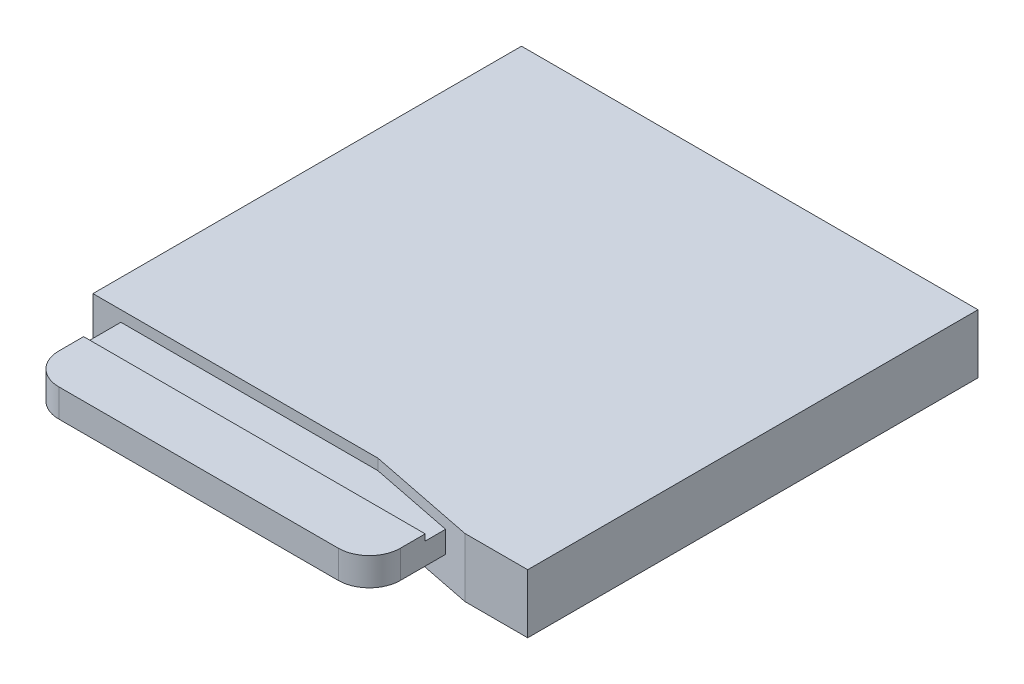
ISO-10303-21;
HEADER;
FILE_DESCRIPTION(('STEP AP214'),'2;1');
FILE_NAME('part.step','',(''),(''),'','','');
FILE_SCHEMA(('AUTOMOTIVE_DESIGN { 1 0 10303 214 1 1 1 1 }'));
ENDSEC;
DATA;
#1=APPLICATION_CONTEXT('core data for automotive mechanical design processes');
#2=APPLICATION_PROTOCOL_DEFINITION('international standard','automotive_design',2000,#1);
#3=PRODUCT_CONTEXT('',#1,'mechanical');
#4=PRODUCT('Part','Part','',(#3));
#5=PRODUCT_RELATED_PRODUCT_CATEGORY('part','',(#4));
#6=PRODUCT_DEFINITION_FORMATION('','',#4);
#7=PRODUCT_DEFINITION_CONTEXT('part definition',#1,'design');
#8=PRODUCT_DEFINITION('design','',#6,#7);
#9=PRODUCT_DEFINITION_SHAPE('','',#8);
#10=(LENGTH_UNIT() NAMED_UNIT(*) SI_UNIT(.MILLI.,.METRE.));
#11=(NAMED_UNIT(*) PLANE_ANGLE_UNIT() SI_UNIT($,.RADIAN.));
#12=(NAMED_UNIT(*) SI_UNIT($,.STERADIAN.) SOLID_ANGLE_UNIT());
#13=UNCERTAINTY_MEASURE_WITH_UNIT(LENGTH_MEASURE(1.E-05),#10,'distance_accuracy_value','');
#14=(GEOMETRIC_REPRESENTATION_CONTEXT(3) GLOBAL_UNCERTAINTY_ASSIGNED_CONTEXT((#13)) GLOBAL_UNIT_ASSIGNED_CONTEXT((#10,
#11,#12)) REPRESENTATION_CONTEXT('',''));
#15=CARTESIAN_POINT('',(0.,0.,0.));
#16=DIRECTION('',(0.,0.,1.));
#17=DIRECTION('',(1.,0.,0.));
#18=AXIS2_PLACEMENT_3D('',#15,#16,#17);
#19=CARTESIAN_POINT('',(3.05,-0.55,3.25));
#20=DIRECTION('',(0.,-1.,0.));
#21=DIRECTION('',(0.,0.,-1.));
#22=AXIS2_PLACEMENT_3D('',#19,#20,#21);
#23=PLANE('',#22);
#24=CARTESIAN_POINT('',(3.05,-0.55,3.25));
#25=DIRECTION('',(0.,-1.,0.));
#26=DIRECTION('',(0.,0.,-1.));
#27=AXIS2_PLACEMENT_3D('',#24,#25,#26);
#28=CIRCLE('',#27,0.3);
#29=CARTESIAN_POINT('',(3.05,-0.55,2.95));
#30=VERTEX_POINT('',#29);
#31=EDGE_CURVE('E377',#30,#30,#28,.T.);
#32=ORIENTED_EDGE('',*,*,#31,.T.);
#33=EDGE_LOOP('',(#32));
#34=FACE_BOUND('',#33,.T.);
#35=ADVANCED_FACE('F17',(#34),#23,.T.);
#36=CARTESIAN_POINT('',(-4.95,-0.55,3.25));
#37=DIRECTION('',(0.,-1.,0.));
#38=DIRECTION('',(0.,0.,-1.));
#39=AXIS2_PLACEMENT_3D('',#36,#37,#38);
#40=PLANE('',#39);
#41=CARTESIAN_POINT('',(-4.95,-0.55,3.25));
#42=DIRECTION('',(0.,-1.,0.));
#43=DIRECTION('',(0.,0.,-1.));
#44=AXIS2_PLACEMENT_3D('',#41,#42,#43);
#45=CIRCLE('',#44,0.3);
#46=CARTESIAN_POINT('',(-4.95,-0.55,2.95));
#47=VERTEX_POINT('',#46);
#48=EDGE_CURVE('E385',#47,#47,#45,.T.);
#49=ORIENTED_EDGE('',*,*,#48,.T.);
#50=EDGE_LOOP('',(#49));
#51=FACE_BOUND('',#50,.T.);
#52=ADVANCED_FACE('F419',(#51),#40,.T.);
#53=CARTESIAN_POINT('',(3.55,0.,8.55));
#54=DIRECTION('',(0.,-1.,0.));
#55=DIRECTION('',(0.,0.,-1.));
#56=AXIS2_PLACEMENT_3D('',#53,#54,#55);
#57=CYLINDRICAL_SURFACE('',#56,1.);
#58=CARTESIAN_POINT('',(3.55,0.85,8.55));
#59=DIRECTION('',(0.,-1.,0.));
#60=DIRECTION('',(-1.,0.,0.));
#61=AXIS2_PLACEMENT_3D('',#58,#59,#60);
#62=CIRCLE('',#61,1.);
#63=CARTESIAN_POINT('',(4.55,0.85,8.55));
#64=VERTEX_POINT('',#63);
#65=CARTESIAN_POINT('',(3.55,0.85,9.55));
#66=VERTEX_POINT('',#65);
#67=EDGE_CURVE('E184',#64,#66,#62,.T.);
#68=ORIENTED_EDGE('',*,*,#67,.F.);
#69=DIRECTION('',(0.,-1.,0.));
#70=VECTOR('',#69,1.);
#71=CARTESIAN_POINT('',(4.55,0.85,8.55));
#72=LINE('',#71,#70);
#73=CARTESIAN_POINT('',(4.55,1.75,8.55));
#74=VERTEX_POINT('',#73);
#75=EDGE_CURVE('E233',#74,#64,#72,.T.);
#76=ORIENTED_EDGE('',*,*,#75,.F.);
#77=CARTESIAN_POINT('',(3.55,1.75,8.55));
#78=DIRECTION('',(0.,1.,0.));
#79=DIRECTION('',(1.,0.,0.));
#80=AXIS2_PLACEMENT_3D('',#77,#78,#79);
#81=CIRCLE('',#80,1.);
#82=CARTESIAN_POINT('',(3.55,1.75,9.55));
#83=VERTEX_POINT('',#82);
#84=EDGE_CURVE('E11',#83,#74,#81,.T.);
#85=ORIENTED_EDGE('',*,*,#84,.F.);
#86=DIRECTION('',(0.,1.,0.));
#87=VECTOR('',#86,1.);
#88=CARTESIAN_POINT('',(3.55,1.75,9.55));
#89=LINE('',#88,#87);
#90=EDGE_CURVE('E163',#66,#83,#89,.T.);
#91=ORIENTED_EDGE('',*,*,#90,.F.);
#92=EDGE_LOOP('',(#68,#76,#85,#91));
#93=FACE_BOUND('',#92,.T.);
#94=ADVANCED_FACE('F276',(#93),#57,.T.);
#95=CARTESIAN_POINT('',(-5.45,0.,8.55));
#96=DIRECTION('',(0.,1.,0.));
#97=DIRECTION('',(0.,0.,1.));
#98=AXIS2_PLACEMENT_3D('',#95,#96,#97);
#99=CYLINDRICAL_SURFACE('',#98,1.);
#100=CARTESIAN_POINT('',(-5.45,1.75,8.55));
#101=DIRECTION('',(0.,1.,0.));
#102=DIRECTION('',(1.,0.,0.));
#103=AXIS2_PLACEMENT_3D('',#100,#101,#102);
#104=CIRCLE('',#103,1.);
#105=CARTESIAN_POINT('',(-6.45,1.75,8.55));
#106=VERTEX_POINT('',#105);
#107=CARTESIAN_POINT('',(-5.45,1.75,9.55));
#108=VERTEX_POINT('',#107);
#109=EDGE_CURVE('E26',#106,#108,#104,.T.);
#110=ORIENTED_EDGE('',*,*,#109,.F.);
#111=DIRECTION('',(0.,1.,0.));
#112=VECTOR('',#111,1.);
#113=CARTESIAN_POINT('',(-6.45,1.75,8.55));
#114=LINE('',#113,#112);
#115=CARTESIAN_POINT('',(-6.45,0.85,8.55));
#116=VERTEX_POINT('',#115);
#117=EDGE_CURVE('E177',#116,#106,#114,.T.);
#118=ORIENTED_EDGE('',*,*,#117,.F.);
#119=CARTESIAN_POINT('',(-5.45,0.85,8.55));
#120=DIRECTION('',(0.,-1.,0.));
#121=DIRECTION('',(-1.,0.,0.));
#122=AXIS2_PLACEMENT_3D('',#119,#120,#121);
#123=CIRCLE('',#122,1.);
#124=CARTESIAN_POINT('',(-5.45,0.85,9.55));
#125=VERTEX_POINT('',#124);
#126=EDGE_CURVE('E249',#125,#116,#123,.T.);
#127=ORIENTED_EDGE('',*,*,#126,.F.);
#128=DIRECTION('',(0.,-1.,0.));
#129=VECTOR('',#128,1.);
#130=CARTESIAN_POINT('',(-5.45,0.85,9.55));
#131=LINE('',#130,#129);
#132=EDGE_CURVE('E245',#108,#125,#131,.T.);
#133=ORIENTED_EDGE('',*,*,#132,.F.);
#134=EDGE_LOOP('',(#110,#118,#127,#133));
#135=FACE_BOUND('',#134,.T.);
#136=ADVANCED_FACE('F270',(#135),#99,.T.);
#137=CARTESIAN_POINT('',(0.,1.75,0.));
#138=DIRECTION('',(0.,-1.,0.));
#139=DIRECTION('',(0.,0.,-1.));
#140=AXIS2_PLACEMENT_3D('',#137,#138,#139);
#141=PLANE('',#140);
#142=DIRECTION('',(0.,0.,1.));
#143=VECTOR('',#142,1.);
#144=CARTESIAN_POINT('',(-6.45,1.75,9.55));
#145=LINE('',#144,#143);
#146=CARTESIAN_POINT('',(-6.45,1.75,7.75));
#147=VERTEX_POINT('',#146);
#148=EDGE_CURVE('E156',#147,#106,#145,.T.);
#149=ORIENTED_EDGE('',*,*,#148,.T.);
#150=ORIENTED_EDGE('',*,*,#109,.T.);
#151=DIRECTION('',(1.,0.,0.));
#152=VECTOR('',#151,1.);
#153=CARTESIAN_POINT('',(-6.45,1.75,9.55));
#154=LINE('',#153,#152);
#155=EDGE_CURVE('E173',#108,#83,#154,.T.);
#156=ORIENTED_EDGE('',*,*,#155,.T.);
#157=ORIENTED_EDGE('',*,*,#84,.T.);
#158=DIRECTION('',(0.,0.,-1.));
#159=VECTOR('',#158,1.);
#160=CARTESIAN_POINT('',(4.55,1.75,9.55));
#161=LINE('',#160,#159);
#162=CARTESIAN_POINT('',(4.55,1.75,7.75));
#163=VERTEX_POINT('',#162);
#164=EDGE_CURVE('E159',#74,#163,#161,.T.);
#165=ORIENTED_EDGE('',*,*,#164,.T.);
#166=DIRECTION('',(-1.,0.,0.));
#167=VECTOR('',#166,1.);
#168=CARTESIAN_POINT('',(-6.45,1.75,7.75));
#169=LINE('',#168,#167);
#170=EDGE_CURVE('E152',#163,#147,#169,.T.);
#171=ORIENTED_EDGE('',*,*,#170,.T.);
#172=EDGE_LOOP('',(#149,#150,#156,#157,#165,#171));
#173=FACE_BOUND('',#172,.T.);
#174=ADVANCED_FACE('F154',(#173),#141,.F.);
#175=CARTESIAN_POINT('',(-6.45,1.75,7.75));
#176=DIRECTION('',(0.,0.,1.));
#177=DIRECTION('',(1.,0.,0.));
#178=AXIS2_PLACEMENT_3D('',#175,#176,#177);
#179=PLANE('',#178);
#180=DIRECTION('',(-1.,0.,0.));
#181=VECTOR('',#180,1.);
#182=CARTESIAN_POINT('',(-6.45,1.55,7.75));
#183=LINE('',#182,#181);
#184=CARTESIAN_POINT('',(4.55,1.55,7.75));
#185=VERTEX_POINT('',#184);
#186=CARTESIAN_POINT('',(-6.45,1.55,7.75));
#187=VERTEX_POINT('',#186);
#188=EDGE_CURVE('E168',#185,#187,#183,.T.);
#189=ORIENTED_EDGE('',*,*,#188,.T.);
#190=DIRECTION('',(0.,-1.,0.));
#191=VECTOR('',#190,1.);
#192=CARTESIAN_POINT('',(-6.45,1.75,7.75));
#193=LINE('',#192,#191);
#194=EDGE_CURVE('E165',#147,#187,#193,.T.);
#195=ORIENTED_EDGE('',*,*,#194,.F.);
#196=ORIENTED_EDGE('',*,*,#170,.F.);
#197=DIRECTION('',(0.,-1.,0.));
#198=VECTOR('',#197,1.);
#199=CARTESIAN_POINT('',(4.55,1.75,7.75));
#200=LINE('',#199,#198);
#201=EDGE_CURVE('E238',#163,#185,#200,.T.);
#202=ORIENTED_EDGE('',*,*,#201,.T.);
#203=EDGE_LOOP('',(#189,#195,#196,#202));
#204=FACE_BOUND('',#203,.T.);
#205=ADVANCED_FACE('F166',(#204),#179,.F.);
#206=CARTESIAN_POINT('',(0.,0.,9.55));
#207=DIRECTION('',(0.,0.,1.));
#208=DIRECTION('',(1.,0.,0.));
#209=AXIS2_PLACEMENT_3D('',#206,#207,#208);
#210=PLANE('',#209);
#211=ORIENTED_EDGE('',*,*,#155,.F.);
#212=ORIENTED_EDGE('',*,*,#132,.T.);
#213=DIRECTION('',(1.,0.,0.));
#214=VECTOR('',#213,1.);
#215=CARTESIAN_POINT('',(-6.45,0.85,9.55));
#216=LINE('',#215,#214);
#217=EDGE_CURVE('E241',#125,#66,#216,.T.);
#218=ORIENTED_EDGE('',*,*,#217,.T.);
#219=ORIENTED_EDGE('',*,*,#90,.T.);
#220=EDGE_LOOP('',(#211,#212,#218,#219));
#221=FACE_BOUND('',#220,.T.);
#222=ADVANCED_FACE('F265',(#221),#210,.T.);
#223=CARTESIAN_POINT('',(-6.45,1.55,9.55));
#224=DIRECTION('',(1.,0.,0.));
#225=DIRECTION('',(0.,1.,0.));
#226=AXIS2_PLACEMENT_3D('',#223,#224,#225);
#227=PLANE('',#226);
#228=DIRECTION('',(0.,0.,-1.));
#229=VECTOR('',#228,1.);
#230=CARTESIAN_POINT('',(-6.45,0.85,9.55));
#231=LINE('',#230,#229);
#232=CARTESIAN_POINT('',(-6.45,0.85,6.55));
#233=VERTEX_POINT('',#232);
#234=EDGE_CURVE('E253',#116,#233,#231,.T.);
#235=ORIENTED_EDGE('',*,*,#234,.F.);
#236=ORIENTED_EDGE('',*,*,#117,.T.);
#237=ORIENTED_EDGE('',*,*,#148,.F.);
#238=ORIENTED_EDGE('',*,*,#194,.T.);
#239=DIRECTION('',(0.,0.,-1.));
#240=VECTOR('',#239,1.);
#241=CARTESIAN_POINT('',(-6.45,1.55,9.55));
#242=LINE('',#241,#240);
#243=CARTESIAN_POINT('',(-6.45,1.55,6.55));
#244=VERTEX_POINT('',#243);
#245=EDGE_CURVE('E294',#187,#244,#242,.T.);
#246=ORIENTED_EDGE('',*,*,#245,.T.);
#247=DIRECTION('',(0.,-1.,0.));
#248=VECTOR('',#247,1.);
#249=CARTESIAN_POINT('',(-6.45,1.55,6.55));
#250=LINE('',#249,#248);
#251=EDGE_CURVE('E188',#244,#233,#250,.T.);
#252=ORIENTED_EDGE('',*,*,#251,.T.);
#253=EDGE_LOOP('',(#235,#236,#237,#238,#246,#252));
#254=FACE_BOUND('',#253,.T.);
#255=ADVANCED_FACE('F176',(#254),#227,.F.);
#256=CARTESIAN_POINT('',(-6.45,0.85,9.55));
#257=DIRECTION('',(0.,1.,0.));
#258=DIRECTION('',(1.,0.,0.));
#259=AXIS2_PLACEMENT_3D('',#256,#257,#258);
#260=PLANE('',#259);
#261=ORIENTED_EDGE('',*,*,#217,.F.);
#262=ORIENTED_EDGE('',*,*,#126,.T.);
#263=ORIENTED_EDGE('',*,*,#234,.T.);
#264=DIRECTION('',(1.,0.,0.));
#265=VECTOR('',#264,1.);
#266=CARTESIAN_POINT('',(-6.45,0.85,6.55));
#267=LINE('',#266,#265);
#268=CARTESIAN_POINT('',(1.824899913558,0.85,6.55));
#269=VERTEX_POINT('',#268);
#270=EDGE_CURVE('E337',#233,#269,#267,.T.);
#271=ORIENTED_EDGE('',*,*,#270,.T.);
#272=DIRECTION('',(0.980618969510392,0.,0.195924568741078));
#273=VECTOR('',#272,1.);
#274=CARTESIAN_POINT('',(1.824899913558,0.85,6.55));
#275=LINE('',#274,#273);
#276=CARTESIAN_POINT('',(4.55,0.85,7.094466378698));
#277=VERTEX_POINT('',#276);
#278=EDGE_CURVE('E309',#269,#277,#275,.T.);
#279=ORIENTED_EDGE('',*,*,#278,.T.);
#280=DIRECTION('',(0.,0.,-1.));
#281=VECTOR('',#280,1.);
#282=CARTESIAN_POINT('',(4.55,0.85,9.55));
#283=LINE('',#282,#281);
#284=EDGE_CURVE('E235',#64,#277,#283,.T.);
#285=ORIENTED_EDGE('',*,*,#284,.F.);
#286=ORIENTED_EDGE('',*,*,#67,.T.);
#287=EDGE_LOOP('',(#261,#262,#263,#271,#279,#285,#286));
#288=FACE_BOUND('',#287,.T.);
#289=ADVANCED_FACE('F272',(#288),#260,.F.);
#290=CARTESIAN_POINT('',(4.55,1.55,9.55));
#291=DIRECTION('',(-1.,0.,0.));
#292=DIRECTION('',(0.,0.,1.));
#293=AXIS2_PLACEMENT_3D('',#290,#291,#292);
#294=PLANE('',#293);
#295=ORIENTED_EDGE('',*,*,#164,.F.);
#296=ORIENTED_EDGE('',*,*,#75,.T.);
#297=ORIENTED_EDGE('',*,*,#284,.T.);
#298=DIRECTION('',(0.,1.,0.));
#299=VECTOR('',#298,1.);
#300=CARTESIAN_POINT('',(4.55,30.194044639029,7.094466378698));
#301=LINE('',#300,#299);
#302=CARTESIAN_POINT('',(4.55,1.55,7.094466378698));
#303=VERTEX_POINT('',#302);
#304=EDGE_CURVE('E285',#277,#303,#301,.T.);
#305=ORIENTED_EDGE('',*,*,#304,.T.);
#306=DIRECTION('',(0.,0.,-1.));
#307=VECTOR('',#306,1.);
#308=CARTESIAN_POINT('',(4.55,1.55,9.55));
#309=LINE('',#308,#307);
#310=EDGE_CURVE('E283',#185,#303,#309,.T.);
#311=ORIENTED_EDGE('',*,*,#310,.F.);
#312=ORIENTED_EDGE('',*,*,#201,.F.);
#313=EDGE_LOOP('',(#295,#296,#297,#305,#311,#312));
#314=FACE_BOUND('',#313,.T.);
#315=ADVANCED_FACE('F280',(#314),#294,.F.);
#316=CARTESIAN_POINT('',(0.,1.9,0.));
#317=DIRECTION('',(0.,-1.,0.));
#318=DIRECTION('',(0.,0.,-1.));
#319=AXIS2_PLACEMENT_3D('',#316,#317,#318);
#320=PLANE('',#319);
#321=DIRECTION('',(-1.,0.,0.));
#322=VECTOR('',#321,1.);
#323=CARTESIAN_POINT('',(-7.35,1.9,6.55));
#324=LINE('',#323,#322);
#325=CARTESIAN_POINT('',(1.824899913558,1.9,6.55));
#326=VERTEX_POINT('',#325);
#327=CARTESIAN_POINT('',(-7.35,1.9,6.55));
#328=VERTEX_POINT('',#327);
#329=EDGE_CURVE('E190',#326,#328,#324,.T.);
#330=ORIENTED_EDGE('',*,*,#329,.F.);
#331=DIRECTION('',(-0.980618969510392,0.,-0.195924568741078));
#332=VECTOR('',#331,1.);
#333=CARTESIAN_POINT('',(1.824899913558,1.9,6.55));
#334=LINE('',#333,#332);
#335=CARTESIAN_POINT('',(5.328458875404,1.9,7.25));
#336=VERTEX_POINT('',#335);
#337=EDGE_CURVE('E325',#336,#326,#334,.T.);
#338=ORIENTED_EDGE('',*,*,#337,.F.);
#339=DIRECTION('',(1.,0.,0.));
#340=VECTOR('',#339,1.);
#341=CARTESIAN_POINT('',(-7.35,1.9,7.25));
#342=LINE('',#341,#340);
#343=CARTESIAN_POINT('',(7.35,1.9,7.25));
#344=VERTEX_POINT('',#343);
#345=EDGE_CURVE('E229',#336,#344,#342,.T.);
#346=ORIENTED_EDGE('',*,*,#345,.T.);
#347=DIRECTION('',(0.,0.,-1.));
#348=VECTOR('',#347,1.);
#349=CARTESIAN_POINT('',(7.35,1.9,7.25));
#350=LINE('',#349,#348);
#351=CARTESIAN_POINT('',(7.35,1.9,-7.25));
#352=VERTEX_POINT('',#351);
#353=EDGE_CURVE('E216',#344,#352,#350,.T.);
#354=ORIENTED_EDGE('',*,*,#353,.T.);
#355=DIRECTION('',(-1.,0.,0.));
#356=VECTOR('',#355,1.);
#357=CARTESIAN_POINT('',(-7.35,1.9,-7.25));
#358=LINE('',#357,#356);
#359=CARTESIAN_POINT('',(-7.35,1.9,-7.25));
#360=VERTEX_POINT('',#359);
#361=EDGE_CURVE('E224',#352,#360,#358,.T.);
#362=ORIENTED_EDGE('',*,*,#361,.T.);
#363=DIRECTION('',(0.,0.,1.));
#364=VECTOR('',#363,1.);
#365=CARTESIAN_POINT('',(-7.35,1.9,7.25));
#366=LINE('',#365,#364);
#367=EDGE_CURVE('E228',#360,#328,#366,.T.);
#368=ORIENTED_EDGE('',*,*,#367,.T.);
#369=EDGE_LOOP('',(#330,#338,#346,#354,#362,#368));
#370=FACE_BOUND('',#369,.T.);
#371=ADVANCED_FACE('F357',(#370),#320,.F.);
#372=CARTESIAN_POINT('',(-7.35,1.9,7.25));
#373=DIRECTION('',(0.,0.,-1.));
#374=DIRECTION('',(0.,-1.,0.));
#375=AXIS2_PLACEMENT_3D('',#372,#373,#374);
#376=PLANE('',#375);
#377=ORIENTED_EDGE('',*,*,#345,.F.);
#378=DIRECTION('',(0.,-1.,0.));
#379=VECTOR('',#378,1.);
#380=CARTESIAN_POINT('',(5.328458875404,30.194044639029,7.25));
#381=LINE('',#380,#379);
#382=CARTESIAN_POINT('',(5.328458875404,0.,7.25));
#383=VERTEX_POINT('',#382);
#384=EDGE_CURVE('E329',#336,#383,#381,.T.);
#385=ORIENTED_EDGE('',*,*,#384,.T.);
#386=DIRECTION('',(1.,0.,0.));
#387=VECTOR('',#386,1.);
#388=CARTESIAN_POINT('',(-7.35,0.,7.25));
#389=LINE('',#388,#387);
#390=CARTESIAN_POINT('',(7.35,0.,7.25));
#391=VERTEX_POINT('',#390);
#392=EDGE_CURVE('E207',#383,#391,#389,.T.);
#393=ORIENTED_EDGE('',*,*,#392,.T.);
#394=DIRECTION('',(0.,-1.,0.));
#395=VECTOR('',#394,1.);
#396=CARTESIAN_POINT('',(7.35,1.9,7.25));
#397=LINE('',#396,#395);
#398=EDGE_CURVE('E220',#344,#391,#397,.T.);
#399=ORIENTED_EDGE('',*,*,#398,.F.);
#400=EDGE_LOOP('',(#377,#385,#393,#399));
#401=FACE_BOUND('',#400,.T.);
#402=ADVANCED_FACE('F439',(#401),#376,.F.);
#403=CARTESIAN_POINT('',(-7.35,1.9,7.25));
#404=DIRECTION('',(1.,0.,0.));
#405=DIRECTION('',(0.,1.,0.));
#406=AXIS2_PLACEMENT_3D('',#403,#404,#405);
#407=PLANE('',#406);
#408=DIRECTION('',(0.,0.,1.));
#409=VECTOR('',#408,1.);
#410=CARTESIAN_POINT('',(-7.35,0.,7.25));
#411=LINE('',#410,#409);
#412=CARTESIAN_POINT('',(-7.35,0.,-7.25));
#413=VERTEX_POINT('',#412);
#414=CARTESIAN_POINT('',(-7.35,0.,6.55));
#415=VERTEX_POINT('',#414);
#416=EDGE_CURVE('E201',#413,#415,#411,.T.);
#417=ORIENTED_EDGE('',*,*,#416,.T.);
#418=DIRECTION('',(0.,-1.,0.));
#419=VECTOR('',#418,1.);
#420=CARTESIAN_POINT('',(-7.35,30.194044639029,6.55));
#421=LINE('',#420,#419);
#422=EDGE_CURVE('E193',#328,#415,#421,.T.);
#423=ORIENTED_EDGE('',*,*,#422,.F.);
#424=ORIENTED_EDGE('',*,*,#367,.F.);
#425=DIRECTION('',(0.,-1.,0.));
#426=VECTOR('',#425,1.);
#427=CARTESIAN_POINT('',(-7.35,1.9,-7.25));
#428=LINE('',#427,#426);
#429=EDGE_CURVE('E221',#360,#413,#428,.T.);
#430=ORIENTED_EDGE('',*,*,#429,.T.);
#431=EDGE_LOOP('',(#417,#423,#424,#430));
#432=FACE_BOUND('',#431,.T.);
#433=ADVANCED_FACE('F362',(#432),#407,.F.);
#434=CARTESIAN_POINT('',(-7.35,1.9,-7.25));
#435=DIRECTION('',(0.,0.,1.));
#436=DIRECTION('',(1.,0.,0.));
#437=AXIS2_PLACEMENT_3D('',#434,#435,#436);
#438=PLANE('',#437);
#439=DIRECTION('',(-1.,0.,0.));
#440=VECTOR('',#439,1.);
#441=CARTESIAN_POINT('',(-7.35,0.,-7.25));
#442=LINE('',#441,#440);
#443=CARTESIAN_POINT('',(7.35,0.,-7.25));
#444=VERTEX_POINT('',#443);
#445=EDGE_CURVE('E202',#444,#413,#442,.T.);
#446=ORIENTED_EDGE('',*,*,#445,.T.);
#447=ORIENTED_EDGE('',*,*,#429,.F.);
#448=ORIENTED_EDGE('',*,*,#361,.F.);
#449=DIRECTION('',(0.,-1.,0.));
#450=VECTOR('',#449,1.);
#451=CARTESIAN_POINT('',(7.35,1.9,-7.25));
#452=LINE('',#451,#450);
#453=EDGE_CURVE('E211',#352,#444,#452,.T.);
#454=ORIENTED_EDGE('',*,*,#453,.T.);
#455=EDGE_LOOP('',(#446,#447,#448,#454));
#456=FACE_BOUND('',#455,.T.);
#457=ADVANCED_FACE('F438',(#456),#438,.F.);
#458=CARTESIAN_POINT('',(7.35,1.9,7.25));
#459=DIRECTION('',(-1.,0.,0.));
#460=DIRECTION('',(0.,0.,1.));
#461=AXIS2_PLACEMENT_3D('',#458,#459,#460);
#462=PLANE('',#461);
#463=DIRECTION('',(0.,0.,-1.));
#464=VECTOR('',#463,1.);
#465=CARTESIAN_POINT('',(7.35,0.,7.25));
#466=LINE('',#465,#464);
#467=EDGE_CURVE('E206',#391,#444,#466,.T.);
#468=ORIENTED_EDGE('',*,*,#467,.T.);
#469=ORIENTED_EDGE('',*,*,#453,.F.);
#470=ORIENTED_EDGE('',*,*,#353,.F.);
#471=ORIENTED_EDGE('',*,*,#398,.T.);
#472=EDGE_LOOP('',(#468,#469,#470,#471));
#473=FACE_BOUND('',#472,.T.);
#474=ADVANCED_FACE('F445',(#473),#462,.F.);
#475=CARTESIAN_POINT('',(0.,0.,0.));
#476=DIRECTION('',(0.,-1.,0.));
#477=DIRECTION('',(0.,0.,-1.));
#478=AXIS2_PLACEMENT_3D('',#475,#476,#477);
#479=PLANE('',#478);
#480=DIRECTION('',(-0.980618969510392,0.,-0.195924568741078));
#481=VECTOR('',#480,1.);
#482=CARTESIAN_POINT('',(1.824899913558,0.,6.55));
#483=LINE('',#482,#481);
#484=CARTESIAN_POINT('',(1.824899913558,0.,6.55));
#485=VERTEX_POINT('',#484);
#486=EDGE_CURVE('E324',#383,#485,#483,.T.);
#487=ORIENTED_EDGE('',*,*,#486,.T.);
#488=DIRECTION('',(-1.,0.,0.));
#489=VECTOR('',#488,1.);
#490=CARTESIAN_POINT('',(-7.35,0.,6.55));
#491=LINE('',#490,#489);
#492=EDGE_CURVE('E197',#485,#415,#491,.T.);
#493=ORIENTED_EDGE('',*,*,#492,.T.);
#494=ORIENTED_EDGE('',*,*,#416,.F.);
#495=ORIENTED_EDGE('',*,*,#445,.F.);
#496=ORIENTED_EDGE('',*,*,#467,.F.);
#497=ORIENTED_EDGE('',*,*,#392,.F.);
#498=EDGE_LOOP('',(#487,#493,#494,#495,#496,#497));
#499=FACE_BOUND('',#498,.T.);
#500=CARTESIAN_POINT('',(-4.95,0.,3.25));
#501=DIRECTION('',(0.,-1.,0.));
#502=DIRECTION('',(0.,0.,-1.));
#503=AXIS2_PLACEMENT_3D('',#500,#501,#502);
#504=CIRCLE('',#503,0.4);
#505=CARTESIAN_POINT('',(-4.95,0.,2.85));
#506=VERTEX_POINT('',#505);
#507=EDGE_CURVE('E296',#506,#506,#504,.T.);
#508=ORIENTED_EDGE('',*,*,#507,.F.);
#509=EDGE_LOOP('',(#508));
#510=FACE_BOUND('',#509,.T.);
#511=CARTESIAN_POINT('',(3.05,0.,3.25));
#512=DIRECTION('',(0.,-1.,0.));
#513=DIRECTION('',(0.,0.,-1.));
#514=AXIS2_PLACEMENT_3D('',#511,#512,#513);
#515=CIRCLE('',#514,0.4);
#516=CARTESIAN_POINT('',(3.05,0.,2.85));
#517=VERTEX_POINT('',#516);
#518=EDGE_CURVE('E303',#517,#517,#515,.T.);
#519=ORIENTED_EDGE('',*,*,#518,.F.);
#520=EDGE_LOOP('',(#519));
#521=FACE_BOUND('',#520,.T.);
#522=ADVANCED_FACE('F368',(#499,#510,#521),#479,.T.);
#523=CARTESIAN_POINT('',(-7.35,30.194044639029,6.55));
#524=DIRECTION('',(0.,0.,-1.));
#525=DIRECTION('',(0.,-1.,0.));
#526=AXIS2_PLACEMENT_3D('',#523,#524,#525);
#527=PLANE('',#526);
#528=ORIENTED_EDGE('',*,*,#270,.F.);
#529=ORIENTED_EDGE('',*,*,#251,.F.);
#530=DIRECTION('',(-1.,0.,0.));
#531=VECTOR('',#530,1.);
#532=CARTESIAN_POINT('',(-7.35,1.55,6.55));
#533=LINE('',#532,#531);
#534=CARTESIAN_POINT('',(1.824899913558,1.55,6.55));
#535=VERTEX_POINT('',#534);
#536=EDGE_CURVE('E310',#535,#244,#533,.T.);
#537=ORIENTED_EDGE('',*,*,#536,.F.);
#538=DIRECTION('',(0.,-1.,0.));
#539=VECTOR('',#538,1.);
#540=CARTESIAN_POINT('',(1.824899913558,30.194044639029,6.55));
#541=LINE('',#540,#539);
#542=EDGE_CURVE('E328',#326,#535,#541,.T.);
#543=ORIENTED_EDGE('',*,*,#542,.F.);
#544=ORIENTED_EDGE('',*,*,#329,.T.);
#545=ORIENTED_EDGE('',*,*,#422,.T.);
#546=ORIENTED_EDGE('',*,*,#492,.F.);
#547=DIRECTION('',(0.,-1.,0.));
#548=VECTOR('',#547,1.);
#549=CARTESIAN_POINT('',(1.824899913558,30.194044639029,6.55));
#550=LINE('',#549,#548);
#551=EDGE_CURVE('E320',#269,#485,#550,.T.);
#552=ORIENTED_EDGE('',*,*,#551,.F.);
#553=EDGE_LOOP('',(#528,#529,#537,#543,#544,#545,#546,#552));
#554=FACE_BOUND('',#553,.T.);
#555=ADVANCED_FACE('F346',(#554),#527,.F.);
#556=CARTESIAN_POINT('',(1.824899913558,30.194044639029,6.55));
#557=DIRECTION('',(0.195924568741078,0.,-0.980618969510392));
#558=DIRECTION('',(0.,-1.,0.));
#559=AXIS2_PLACEMENT_3D('',#556,#557,#558);
#560=PLANE('',#559);
#561=ORIENTED_EDGE('',*,*,#278,.F.);
#562=ORIENTED_EDGE('',*,*,#551,.T.);
#563=ORIENTED_EDGE('',*,*,#486,.F.);
#564=ORIENTED_EDGE('',*,*,#384,.F.);
#565=ORIENTED_EDGE('',*,*,#337,.T.);
#566=ORIENTED_EDGE('',*,*,#542,.T.);
#567=DIRECTION('',(-0.980618969510392,0.,-0.195924568741078));
#568=VECTOR('',#567,1.);
#569=CARTESIAN_POINT('',(1.824899913558,1.55,6.55));
#570=LINE('',#569,#568);
#571=EDGE_CURVE('E290',#303,#535,#570,.T.);
#572=ORIENTED_EDGE('',*,*,#571,.F.);
#573=ORIENTED_EDGE('',*,*,#304,.F.);
#574=EDGE_LOOP('',(#561,#562,#563,#564,#565,#566,#572,#573));
#575=FACE_BOUND('',#574,.T.);
#576=ADVANCED_FACE('F351',(#575),#560,.F.);
#577=CARTESIAN_POINT('',(-6.45,1.55,9.55));
#578=DIRECTION('',(0.,-1.,0.));
#579=DIRECTION('',(0.,0.,-1.));
#580=AXIS2_PLACEMENT_3D('',#577,#578,#579);
#581=PLANE('',#580);
#582=ORIENTED_EDGE('',*,*,#188,.F.);
#583=ORIENTED_EDGE('',*,*,#310,.T.);
#584=ORIENTED_EDGE('',*,*,#571,.T.);
#585=ORIENTED_EDGE('',*,*,#536,.T.);
#586=ORIENTED_EDGE('',*,*,#245,.F.);
#587=EDGE_LOOP('',(#582,#583,#584,#585,#586));
#588=FACE_BOUND('',#587,.T.);
#589=ADVANCED_FACE('F292',(#588),#581,.F.);
#590=CARTESIAN_POINT('',(-4.95,-0.55,3.25));
#591=DIRECTION('',(0.,1.,0.));
#592=DIRECTION('',(0.,0.,1.));
#593=AXIS2_PLACEMENT_3D('',#590,#591,#592);
#594=CYLINDRICAL_SURFACE('',#593,0.4);
#595=ORIENTED_EDGE('',*,*,#507,.T.);
#596=EDGE_LOOP('',(#595));
#597=FACE_BOUND('',#596,.T.);
#598=CARTESIAN_POINT('',(-4.95,-0.45,3.25));
#599=DIRECTION('',(0.,1.,0.));
#600=DIRECTION('',(0.,0.,-1.));
#601=AXIS2_PLACEMENT_3D('',#598,#599,#600);
#602=CIRCLE('',#601,0.4);
#603=CARTESIAN_POINT('',(-4.95,-0.45,2.85));
#604=VERTEX_POINT('',#603);
#605=EDGE_CURVE('E389',#604,#604,#602,.T.);
#606=ORIENTED_EDGE('',*,*,#605,.T.);
#607=EDGE_LOOP('',(#606));
#608=FACE_BOUND('',#607,.T.);
#609=ADVANCED_FACE('F413',(#597,#608),#594,.T.);
#610=CARTESIAN_POINT('',(3.05,-0.55,3.25));
#611=DIRECTION('',(0.,1.,0.));
#612=DIRECTION('',(0.,0.,1.));
#613=AXIS2_PLACEMENT_3D('',#610,#611,#612);
#614=CYLINDRICAL_SURFACE('',#613,0.4);
#615=ORIENTED_EDGE('',*,*,#518,.T.);
#616=EDGE_LOOP('',(#615));
#617=FACE_BOUND('',#616,.T.);
#618=CARTESIAN_POINT('',(3.05,-0.45,3.25));
#619=DIRECTION('',(0.,1.,0.));
#620=DIRECTION('',(0.,0.,-1.));
#621=AXIS2_PLACEMENT_3D('',#618,#619,#620);
#622=CIRCLE('',#621,0.4);
#623=CARTESIAN_POINT('',(3.05,-0.45,2.85));
#624=VERTEX_POINT('',#623);
#625=EDGE_CURVE('E380',#624,#624,#622,.T.);
#626=ORIENTED_EDGE('',*,*,#625,.T.);
#627=EDGE_LOOP('',(#626));
#628=FACE_BOUND('',#627,.T.);
#629=ADVANCED_FACE('F399',(#617,#628),#614,.T.);
#630=CARTESIAN_POINT('',(3.05,-0.45,3.25));
#631=DIRECTION('',(0.,-1.,0.));
#632=DIRECTION('',(0.,0.,-1.));
#633=AXIS2_PLACEMENT_3D('',#630,#631,#632);
#634=TOROIDAL_SURFACE('',#633,0.3,0.1);
#635=ORIENTED_EDGE('',*,*,#31,.F.);
#636=EDGE_LOOP('',(#635));
#637=FACE_BOUND('',#636,.T.);
#638=ORIENTED_EDGE('',*,*,#625,.F.);
#639=EDGE_LOOP('',(#638));
#640=FACE_BOUND('',#639,.T.);
#641=ADVANCED_FACE('F401',(#637,#640),#634,.T.);
#642=CARTESIAN_POINT('',(-4.95,-0.45,3.25));
#643=DIRECTION('',(0.,-1.,0.));
#644=DIRECTION('',(0.,0.,-1.));
#645=AXIS2_PLACEMENT_3D('',#642,#643,#644);
#646=TOROIDAL_SURFACE('',#645,0.3,0.1);
#647=ORIENTED_EDGE('',*,*,#48,.F.);
#648=EDGE_LOOP('',(#647));
#649=FACE_BOUND('',#648,.T.);
#650=ORIENTED_EDGE('',*,*,#605,.F.);
#651=EDGE_LOOP('',(#650));
#652=FACE_BOUND('',#651,.T.);
#653=ADVANCED_FACE('F403',(#649,#652),#646,.T.);
#654=CLOSED_SHELL('',(#35,#52,#94,#136,#174,#205,#222,#255,#289,#315,#371,#402,#433,#457,#474,
#522,#555,#576,#589,#609,#629,#641,#653));
#655=MANIFOLD_SOLID_BREP('B1',#654);
#656=ADVANCED_BREP_SHAPE_REPRESENTATION('',(#18,#655),#14);
#657=SHAPE_DEFINITION_REPRESENTATION(#9,#656);
ENDSEC;
END-ISO-10303-21;
